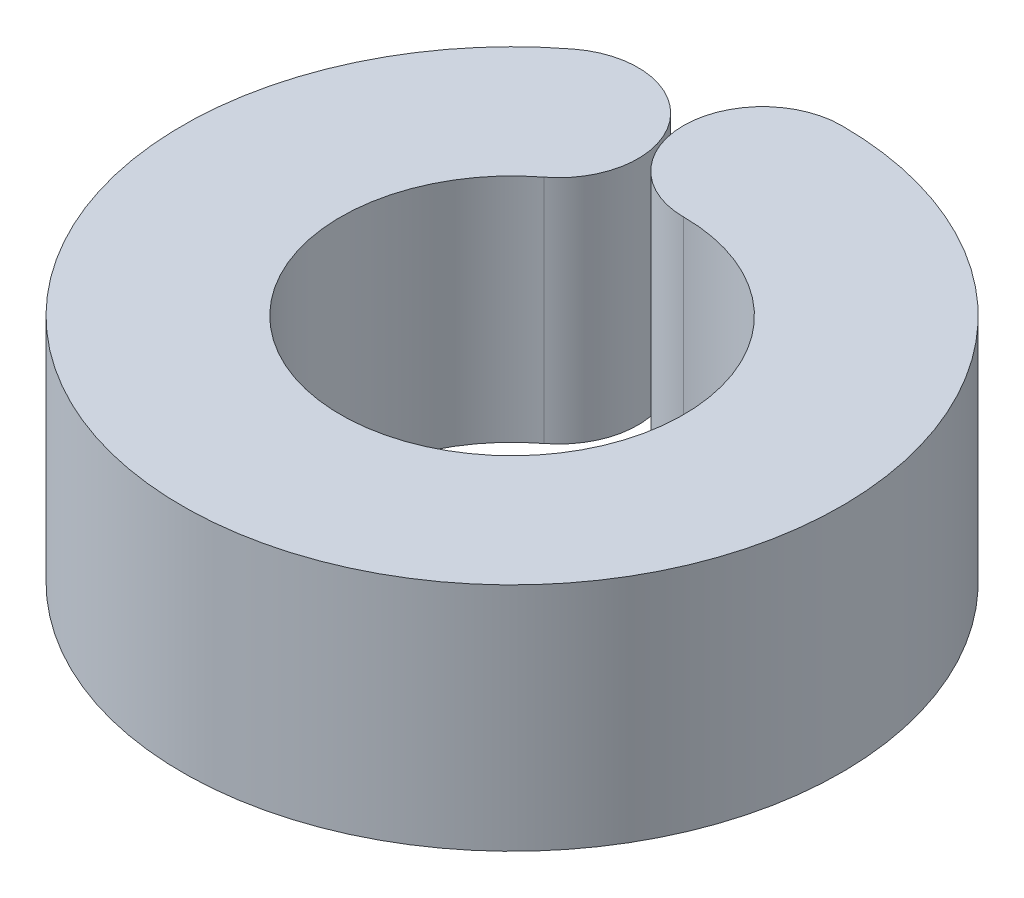
ISO-10303-21;
HEADER;
FILE_DESCRIPTION(('STEP AP214'),'2;1');
FILE_NAME('part.step','',(''),(''),'','','');
FILE_SCHEMA(('AUTOMOTIVE_DESIGN { 1 0 10303 214 1 1 1 1 }'));
ENDSEC;
DATA;
#1=APPLICATION_CONTEXT('core data for automotive mechanical design processes');
#2=APPLICATION_PROTOCOL_DEFINITION('international standard','automotive_design',2000,#1);
#3=PRODUCT_CONTEXT('',#1,'mechanical');
#4=PRODUCT('Part','Part','',(#3));
#5=PRODUCT_RELATED_PRODUCT_CATEGORY('part','',(#4));
#6=PRODUCT_DEFINITION_FORMATION('','',#4);
#7=PRODUCT_DEFINITION_CONTEXT('part definition',#1,'design');
#8=PRODUCT_DEFINITION('design','',#6,#7);
#9=PRODUCT_DEFINITION_SHAPE('','',#8);
#10=(LENGTH_UNIT() NAMED_UNIT(*) SI_UNIT(.MILLI.,.METRE.));
#11=(NAMED_UNIT(*) PLANE_ANGLE_UNIT() SI_UNIT($,.RADIAN.));
#12=(NAMED_UNIT(*) SI_UNIT($,.STERADIAN.) SOLID_ANGLE_UNIT());
#13=UNCERTAINTY_MEASURE_WITH_UNIT(LENGTH_MEASURE(1.E-05),#10,'distance_accuracy_value','');
#14=(GEOMETRIC_REPRESENTATION_CONTEXT(3) GLOBAL_UNCERTAINTY_ASSIGNED_CONTEXT((#13)) GLOBAL_UNIT_ASSIGNED_CONTEXT((#10,
#11,#12)) REPRESENTATION_CONTEXT('',''));
#15=CARTESIAN_POINT('',(0.,0.,0.));
#16=DIRECTION('',(0.,0.,1.));
#17=DIRECTION('',(1.,0.,0.));
#18=AXIS2_PLACEMENT_3D('',#15,#16,#17);
#19=CARTESIAN_POINT('',(0.,3.5,0.));
#20=DIRECTION('',(0.,-1.,0.));
#21=DIRECTION('',(0.,0.,-1.));
#22=AXIS2_PLACEMENT_3D('',#19,#20,#21);
#23=CYLINDRICAL_SURFACE('',#22,2.6);
#24=CARTESIAN_POINT('',(0.,0.,0.));
#25=DIRECTION('',(0.,1.,0.));
#26=DIRECTION('',(0.,0.,1.));
#27=AXIS2_PLACEMENT_3D('',#24,#25,#26);
#28=CIRCLE('',#27,2.6);
#29=CARTESIAN_POINT('',(0.,0.,-2.6));
#30=VERTEX_POINT('',#29);
#31=CARTESIAN_POINT('',(-1.57975097216721,0.,-2.06503919234884));
#32=VERTEX_POINT('',#31);
#33=EDGE_CURVE('E112',#30,#32,#28,.F.);
#34=ORIENTED_EDGE('',*,*,#33,.T.);
#35=DIRECTION('',(0.,-1.,0.));
#36=VECTOR('',#35,1.);
#37=CARTESIAN_POINT('',(-1.57975097216721,3.5,-2.06503919234884));
#38=LINE('',#37,#36);
#39=CARTESIAN_POINT('',(-1.57975097216721,3.5,-2.06503919234884));
#40=VERTEX_POINT('',#39);
#41=EDGE_CURVE('E11',#40,#32,#38,.T.);
#42=ORIENTED_EDGE('',*,*,#41,.F.);
#43=CARTESIAN_POINT('',(0.,3.5,0.));
#44=DIRECTION('',(0.,1.,0.));
#45=DIRECTION('',(0.,0.,1.));
#46=AXIS2_PLACEMENT_3D('',#43,#44,#45);
#47=CIRCLE('',#46,2.6);
#48=CARTESIAN_POINT('',(0.,3.5,-2.6));
#49=VERTEX_POINT('',#48);
#50=EDGE_CURVE('E94',#49,#40,#47,.F.);
#51=ORIENTED_EDGE('',*,*,#50,.F.);
#52=DIRECTION('',(0.,-1.,0.));
#53=VECTOR('',#52,1.);
#54=CARTESIAN_POINT('',(0.,3.5,-2.6));
#55=LINE('',#54,#53);
#56=EDGE_CURVE('E60',#49,#30,#55,.T.);
#57=ORIENTED_EDGE('',*,*,#56,.T.);
#58=EDGE_LOOP('',(#34,#42,#51,#57));
#59=FACE_BOUND('',#58,.T.);
#60=ADVANCED_FACE('F43',(#59),#23,.F.);
#61=CARTESIAN_POINT('',(-2.30886680547515,3.5,-3.01813420420216));
#62=DIRECTION('',(0.,-1.,0.));
#63=DIRECTION('',(0.,0.,-1.));
#64=AXIS2_PLACEMENT_3D('',#61,#62,#63);
#65=CYLINDRICAL_SURFACE('',#64,1.2);
#66=CARTESIAN_POINT('',(-2.30886680547515,0.,-3.01813420420216));
#67=DIRECTION('',(0.,1.,0.));
#68=DIRECTION('',(0.,0.,1.));
#69=AXIS2_PLACEMENT_3D('',#66,#67,#68);
#70=CIRCLE('',#69,1.2);
#71=CARTESIAN_POINT('',(-3.03798263878309,0.,-3.97122921605547));
#72=VERTEX_POINT('',#71);
#73=EDGE_CURVE('E100',#32,#72,#70,.T.);
#74=ORIENTED_EDGE('',*,*,#73,.T.);
#75=DIRECTION('',(0.,-1.,0.));
#76=VECTOR('',#75,1.);
#77=CARTESIAN_POINT('',(-3.03798263878309,3.5,-3.97122921605547));
#78=LINE('',#77,#76);
#79=CARTESIAN_POINT('',(-3.03798263878309,3.5,-3.97122921605547));
#80=VERTEX_POINT('',#79);
#81=EDGE_CURVE('E52',#80,#72,#78,.T.);
#82=ORIENTED_EDGE('',*,*,#81,.F.);
#83=CARTESIAN_POINT('',(-2.30886680547515,3.5,-3.01813420420216));
#84=DIRECTION('',(0.,1.,0.));
#85=DIRECTION('',(0.,0.,1.));
#86=AXIS2_PLACEMENT_3D('',#83,#84,#85);
#87=CIRCLE('',#86,1.2);
#88=EDGE_CURVE('E86',#40,#80,#87,.T.);
#89=ORIENTED_EDGE('',*,*,#88,.F.);
#90=ORIENTED_EDGE('',*,*,#41,.T.);
#91=EDGE_LOOP('',(#74,#82,#89,#90));
#92=FACE_BOUND('',#91,.T.);
#93=ADVANCED_FACE('F99',(#92),#65,.T.);
#94=CARTESIAN_POINT('',(0.,3.5,0.));
#95=DIRECTION('',(0.,-1.,0.));
#96=DIRECTION('',(0.,0.,-1.));
#97=AXIS2_PLACEMENT_3D('',#94,#95,#96);
#98=CYLINDRICAL_SURFACE('',#97,5.);
#99=CARTESIAN_POINT('',(0.,0.,0.));
#100=DIRECTION('',(0.,1.,0.));
#101=DIRECTION('',(0.,0.,1.));
#102=AXIS2_PLACEMENT_3D('',#99,#100,#101);
#103=CIRCLE('',#102,5.);
#104=CARTESIAN_POINT('',(0.,0.,-5.));
#105=VERTEX_POINT('',#104);
#106=EDGE_CURVE('E117',#105,#72,#103,.F.);
#107=ORIENTED_EDGE('',*,*,#106,.F.);
#108=DIRECTION('',(0.,-1.,0.));
#109=VECTOR('',#108,1.);
#110=CARTESIAN_POINT('',(0.,3.5,-5.));
#111=LINE('',#110,#109);
#112=CARTESIAN_POINT('',(0.,3.5,-5.));
#113=VERTEX_POINT('',#112);
#114=EDGE_CURVE('E74',#113,#105,#111,.T.);
#115=ORIENTED_EDGE('',*,*,#114,.F.);
#116=CARTESIAN_POINT('',(0.,3.5,0.));
#117=DIRECTION('',(0.,1.,0.));
#118=DIRECTION('',(0.,0.,1.));
#119=AXIS2_PLACEMENT_3D('',#116,#117,#118);
#120=CIRCLE('',#119,5.);
#121=EDGE_CURVE('E93',#113,#80,#120,.F.);
#122=ORIENTED_EDGE('',*,*,#121,.T.);
#123=ORIENTED_EDGE('',*,*,#81,.T.);
#124=EDGE_LOOP('',(#107,#115,#122,#123));
#125=FACE_BOUND('',#124,.T.);
#126=ADVANCED_FACE('F104',(#125),#98,.T.);
#127=CARTESIAN_POINT('',(0.,3.5,-3.8));
#128=DIRECTION('',(0.,-1.,0.));
#129=DIRECTION('',(0.,0.,-1.));
#130=AXIS2_PLACEMENT_3D('',#127,#128,#129);
#131=CYLINDRICAL_SURFACE('',#130,1.2);
#132=CARTESIAN_POINT('',(0.,0.,-3.8));
#133=DIRECTION('',(0.,1.,0.));
#134=DIRECTION('',(0.,0.,1.));
#135=AXIS2_PLACEMENT_3D('',#132,#133,#134);
#136=CIRCLE('',#135,1.2);
#137=EDGE_CURVE('E120',#30,#105,#136,.F.);
#138=ORIENTED_EDGE('',*,*,#137,.F.);
#139=ORIENTED_EDGE('',*,*,#56,.F.);
#140=CARTESIAN_POINT('',(0.,3.5,-3.8));
#141=DIRECTION('',(0.,1.,0.));
#142=DIRECTION('',(0.,0.,1.));
#143=AXIS2_PLACEMENT_3D('',#140,#141,#142);
#144=CIRCLE('',#143,1.2);
#145=EDGE_CURVE('E106',#49,#113,#144,.F.);
#146=ORIENTED_EDGE('',*,*,#145,.T.);
#147=ORIENTED_EDGE('',*,*,#114,.T.);
#148=EDGE_LOOP('',(#138,#139,#146,#147));
#149=FACE_BOUND('',#148,.T.);
#150=ADVANCED_FACE('F130',(#149),#131,.T.);
#151=CARTESIAN_POINT('',(0.,3.5,0.));
#152=DIRECTION('',(0.,1.,0.));
#153=DIRECTION('',(0.,0.,1.));
#154=AXIS2_PLACEMENT_3D('',#151,#152,#153);
#155=PLANE('',#154);
#156=ORIENTED_EDGE('',*,*,#50,.T.);
#157=ORIENTED_EDGE('',*,*,#88,.T.);
#158=ORIENTED_EDGE('',*,*,#121,.F.);
#159=ORIENTED_EDGE('',*,*,#145,.F.);
#160=EDGE_LOOP('',(#156,#157,#158,#159));
#161=FACE_BOUND('',#160,.T.);
#162=ADVANCED_FACE('F90',(#161),#155,.T.);
#163=CARTESIAN_POINT('',(0.,0.,0.));
#164=DIRECTION('',(0.,1.,0.));
#165=DIRECTION('',(0.,0.,1.));
#166=AXIS2_PLACEMENT_3D('',#163,#164,#165);
#167=PLANE('',#166);
#168=ORIENTED_EDGE('',*,*,#33,.F.);
#169=ORIENTED_EDGE('',*,*,#137,.T.);
#170=ORIENTED_EDGE('',*,*,#106,.T.);
#171=ORIENTED_EDGE('',*,*,#73,.F.);
#172=EDGE_LOOP('',(#168,#169,#170,#171));
#173=FACE_BOUND('',#172,.T.);
#174=ADVANCED_FACE('F129',(#173),#167,.F.);
#175=CLOSED_SHELL('',(#60,#93,#126,#150,#162,#174));
#176=MANIFOLD_SOLID_BREP('B2',#175);
#177=ADVANCED_BREP_SHAPE_REPRESENTATION('',(#18,#176),#14);
#178=SHAPE_DEFINITION_REPRESENTATION(#9,#177);
ENDSEC;
END-ISO-10303-21;
